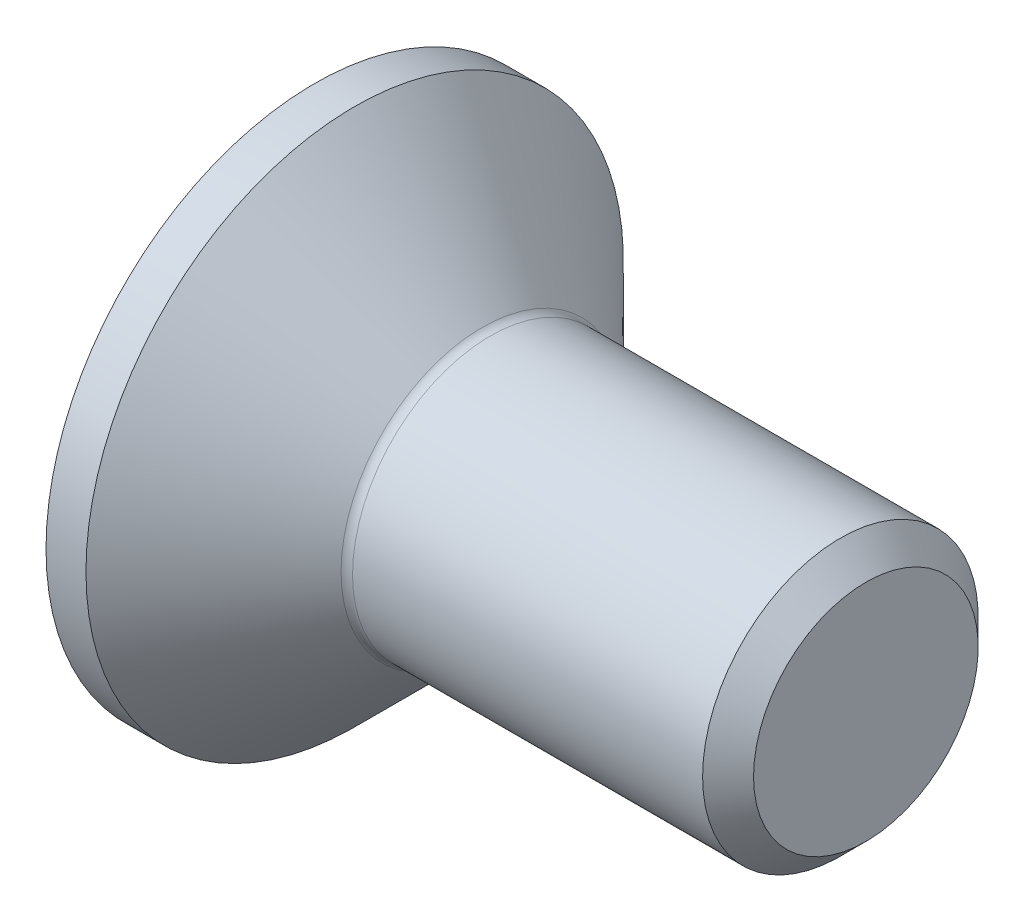
ISO-10303-21;
HEADER;
FILE_DESCRIPTION(('STEP AP214'),'2;1');
FILE_NAME('part.step','',(''),(''),'','','');
FILE_SCHEMA(('AUTOMOTIVE_DESIGN { 1 0 10303 214 1 1 1 1 }'));
ENDSEC;
DATA;
#1=APPLICATION_CONTEXT('core data for automotive mechanical design processes');
#2=APPLICATION_PROTOCOL_DEFINITION('international standard','automotive_design',2000,#1);
#3=PRODUCT_CONTEXT('',#1,'mechanical');
#4=PRODUCT('Part','Part','',(#3));
#5=PRODUCT_RELATED_PRODUCT_CATEGORY('part','',(#4));
#6=PRODUCT_DEFINITION_FORMATION('','',#4);
#7=PRODUCT_DEFINITION_CONTEXT('part definition',#1,'design');
#8=PRODUCT_DEFINITION('design','',#6,#7);
#9=PRODUCT_DEFINITION_SHAPE('','',#8);
#10=(LENGTH_UNIT() NAMED_UNIT(*) SI_UNIT(.MILLI.,.METRE.));
#11=(NAMED_UNIT(*) PLANE_ANGLE_UNIT() SI_UNIT($,.RADIAN.));
#12=(NAMED_UNIT(*) SI_UNIT($,.STERADIAN.) SOLID_ANGLE_UNIT());
#13=UNCERTAINTY_MEASURE_WITH_UNIT(LENGTH_MEASURE(1.E-05),#10,'distance_accuracy_value','');
#14=(GEOMETRIC_REPRESENTATION_CONTEXT(3) GLOBAL_UNCERTAINTY_ASSIGNED_CONTEXT((#13)) GLOBAL_UNIT_ASSIGNED_CONTEXT((#10,
#11,#12)) REPRESENTATION_CONTEXT('',''));
#15=CARTESIAN_POINT('',(0.,0.,0.));
#16=DIRECTION('',(0.,0.,1.));
#17=DIRECTION('',(1.,0.,0.));
#18=AXIS2_PLACEMENT_3D('',#15,#16,#17);
#19=CARTESIAN_POINT('',(0.,0.,0.));
#20=DIRECTION('',(-1.,0.,0.));
#21=DIRECTION('',(0.,0.,1.));
#22=AXIS2_PLACEMENT_3D('',#19,#20,#21);
#23=PLANE('',#22);
#24=CARTESIAN_POINT('',(0.,0.,0.));
#25=DIRECTION('',(-1.,0.,0.));
#26=DIRECTION('',(0.,0.,1.));
#27=AXIS2_PLACEMENT_3D('',#24,#25,#26);
#28=CIRCLE('',#27,5.85);
#29=CARTESIAN_POINT('',(0.,0.,5.85));
#30=VERTEX_POINT('',#29);
#31=EDGE_CURVE('E145',#30,#30,#28,.T.);
#32=ORIENTED_EDGE('',*,*,#31,.T.);
#33=EDGE_LOOP('',(#32));
#34=FACE_BOUND('',#33,.T.);
#35=DIRECTION('',(0.,-0.5,-0.866025403784439));
#36=VECTOR('',#35,1.);
#37=CARTESIAN_POINT('',(0.,-1.15470053837925,2.));
#38=LINE('',#37,#36);
#39=CARTESIAN_POINT('',(0.,-1.15470053837925,2.));
#40=VERTEX_POINT('',#39);
#41=CARTESIAN_POINT('',(0.,-2.3094010767585,0.));
#42=VERTEX_POINT('',#41);
#43=EDGE_CURVE('E121',#40,#42,#38,.T.);
#44=ORIENTED_EDGE('',*,*,#43,.T.);
#45=DIRECTION('',(0.,0.5,-0.866025403784439));
#46=VECTOR('',#45,1.);
#47=CARTESIAN_POINT('',(0.,-2.3094010767585,0.));
#48=LINE('',#47,#46);
#49=CARTESIAN_POINT('',(0.,-1.15470053837925,-2.));
#50=VERTEX_POINT('',#49);
#51=EDGE_CURVE('E52',#42,#50,#48,.T.);
#52=ORIENTED_EDGE('',*,*,#51,.T.);
#53=DIRECTION('',(0.,1.,0.));
#54=VECTOR('',#53,1.);
#55=CARTESIAN_POINT('',(0.,-1.15470053837925,-2.));
#56=LINE('',#55,#54);
#57=CARTESIAN_POINT('',(0.,1.15470053837925,-2.));
#58=VERTEX_POINT('',#57);
#59=EDGE_CURVE('E132',#50,#58,#56,.T.);
#60=ORIENTED_EDGE('',*,*,#59,.T.);
#61=DIRECTION('',(0.,0.5,0.866025403784439));
#62=VECTOR('',#61,1.);
#63=CARTESIAN_POINT('',(0.,1.15470053837925,-2.));
#64=LINE('',#63,#62);
#65=CARTESIAN_POINT('',(0.,2.3094010767585,0.));
#66=VERTEX_POINT('',#65);
#67=EDGE_CURVE('E380',#58,#66,#64,.T.);
#68=ORIENTED_EDGE('',*,*,#67,.T.);
#69=DIRECTION('',(0.,-0.5,0.866025403784438));
#70=VECTOR('',#69,1.);
#71=CARTESIAN_POINT('',(0.,2.3094010767585,0.));
#72=LINE('',#71,#70);
#73=CARTESIAN_POINT('',(0.,1.15470053837925,2.));
#74=VERTEX_POINT('',#73);
#75=EDGE_CURVE('E383',#66,#74,#72,.T.);
#76=ORIENTED_EDGE('',*,*,#75,.T.);
#77=DIRECTION('',(0.,-1.,0.));
#78=VECTOR('',#77,1.);
#79=CARTESIAN_POINT('',(0.,1.15470053837925,2.));
#80=LINE('',#79,#78);
#81=EDGE_CURVE('E386',#74,#40,#80,.T.);
#82=ORIENTED_EDGE('',*,*,#81,.T.);
#83=EDGE_LOOP('',(#44,#52,#60,#68,#76,#82));
#84=FACE_BOUND('',#83,.T.);
#85=ADVANCED_FACE('F37',(#34,#84),#23,.T.);
#86=CARTESIAN_POINT('',(12.,2.4455,0.));
#87=DIRECTION('',(1.,0.,0.));
#88=DIRECTION('',(0.,0.,-1.));
#89=AXIS2_PLACEMENT_3D('',#86,#87,#88);
#90=PLANE('',#89);
#91=CARTESIAN_POINT('',(12.,0.,0.));
#92=DIRECTION('',(-1.,0.,0.));
#93=DIRECTION('',(0.,0.,1.));
#94=AXIS2_PLACEMENT_3D('',#91,#92,#93);
#95=CIRCLE('',#94,2.4455);
#96=CARTESIAN_POINT('',(12.,0.,2.4455));
#97=VERTEX_POINT('',#96);
#98=EDGE_CURVE('E155',#97,#97,#95,.T.);
#99=ORIENTED_EDGE('',*,*,#98,.F.);
#100=EDGE_LOOP('',(#99));
#101=FACE_BOUND('',#100,.T.);
#102=ADVANCED_FACE('F175',(#101),#90,.T.);
#103=CARTESIAN_POINT('',(12.,0.,0.));
#104=DIRECTION('',(-1.,0.,0.));
#105=DIRECTION('',(0.,0.,1.));
#106=AXIS2_PLACEMENT_3D('',#103,#104,#105);
#107=CONICAL_SURFACE('',#106,2.4455,0.785398163397468);
#108=CARTESIAN_POINT('',(11.4455,0.,0.));
#109=DIRECTION('',(-1.,0.,0.));
#110=DIRECTION('',(0.,0.,1.));
#111=AXIS2_PLACEMENT_3D('',#108,#109,#110);
#112=CIRCLE('',#111,3.);
#113=CARTESIAN_POINT('',(11.4455,0.,3.));
#114=VERTEX_POINT('',#113);
#115=EDGE_CURVE('E152',#114,#114,#112,.T.);
#116=ORIENTED_EDGE('',*,*,#115,.F.);
#117=EDGE_LOOP('',(#116));
#118=FACE_BOUND('',#117,.T.);
#119=ORIENTED_EDGE('',*,*,#98,.T.);
#120=EDGE_LOOP('',(#119));
#121=FACE_BOUND('',#120,.T.);
#122=ADVANCED_FACE('F181',(#118,#121),#107,.T.);
#123=CARTESIAN_POINT('',(0.,0.,0.));
#124=DIRECTION('',(-1.,0.,0.));
#125=DIRECTION('',(0.,0.,1.));
#126=AXIS2_PLACEMENT_3D('',#123,#124,#125);
#127=CYLINDRICAL_SURFACE('',#126,3.);
#128=CARTESIAN_POINT('',(3.82355339059328,0.,0.));
#129=DIRECTION('',(-1.,0.,0.));
#130=DIRECTION('',(0.,0.,1.));
#131=AXIS2_PLACEMENT_3D('',#128,#129,#130);
#132=CIRCLE('',#131,3.);
#133=CARTESIAN_POINT('',(3.82355339059328,0.,3.));
#134=VERTEX_POINT('',#133);
#135=EDGE_CURVE('E11',#134,#134,#132,.F.);
#136=ORIENTED_EDGE('',*,*,#135,.T.);
#137=EDGE_LOOP('',(#136));
#138=FACE_BOUND('',#137,.T.);
#139=ORIENTED_EDGE('',*,*,#115,.T.);
#140=EDGE_LOOP('',(#139));
#141=FACE_BOUND('',#140,.T.);
#142=ADVANCED_FACE('F189',(#138,#141),#127,.T.);
#143=CARTESIAN_POINT('',(0.870000000000014,0.,0.));
#144=DIRECTION('',(-1.,0.,0.));
#145=DIRECTION('',(0.,0.,1.));
#146=AXIS2_PLACEMENT_3D('',#143,#144,#145);
#147=CONICAL_SURFACE('',#146,5.85,0.78539816339745);
#148=CARTESIAN_POINT('',(3.64677669529664,0.,0.));
#149=DIRECTION('',(-1.,0.,0.));
#150=DIRECTION('',(0.,0.,1.));
#151=AXIS2_PLACEMENT_3D('',#148,#149,#150);
#152=CIRCLE('',#151,3.07322330470336);
#153=CARTESIAN_POINT('',(3.64677669529664,0.,3.07322330470336));
#154=VERTEX_POINT('',#153);
#155=EDGE_CURVE('E45',#154,#154,#152,.T.);
#156=ORIENTED_EDGE('',*,*,#155,.T.);
#157=EDGE_LOOP('',(#156));
#158=FACE_BOUND('',#157,.T.);
#159=CARTESIAN_POINT('',(0.870000000000014,0.,0.));
#160=DIRECTION('',(-1.,0.,0.));
#161=DIRECTION('',(0.,0.,1.));
#162=AXIS2_PLACEMENT_3D('',#159,#160,#161);
#163=CIRCLE('',#162,5.85);
#164=CARTESIAN_POINT('',(0.870000000000014,0.,5.85));
#165=VERTEX_POINT('',#164);
#166=EDGE_CURVE('E149',#165,#165,#163,.T.);
#167=ORIENTED_EDGE('',*,*,#166,.F.);
#168=EDGE_LOOP('',(#167));
#169=FACE_BOUND('',#168,.T.);
#170=ADVANCED_FACE('F160',(#158,#169),#147,.T.);
#171=CARTESIAN_POINT('',(0.,0.,0.));
#172=DIRECTION('',(-1.,0.,0.));
#173=DIRECTION('',(0.,0.,1.));
#174=AXIS2_PLACEMENT_3D('',#171,#172,#173);
#175=CYLINDRICAL_SURFACE('',#174,5.85);
#176=ORIENTED_EDGE('',*,*,#166,.T.);
#177=EDGE_LOOP('',(#176));
#178=FACE_BOUND('',#177,.T.);
#179=ORIENTED_EDGE('',*,*,#31,.F.);
#180=EDGE_LOOP('',(#179));
#181=FACE_BOUND('',#180,.T.);
#182=ADVANCED_FACE('F164',(#178,#181),#175,.T.);
#183=CARTESIAN_POINT('',(3.82355339059328,0.,0.));
#184=DIRECTION('',(-1.,0.,0.));
#185=DIRECTION('',(0.,0.,1.));
#186=AXIS2_PLACEMENT_3D('',#183,#184,#185);
#187=TOROIDAL_SURFACE('',#186,3.25,0.25);
#188=ORIENTED_EDGE('',*,*,#135,.F.);
#189=EDGE_LOOP('',(#188));
#190=FACE_BOUND('',#189,.T.);
#191=ORIENTED_EDGE('',*,*,#155,.F.);
#192=EDGE_LOOP('',(#191));
#193=FACE_BOUND('',#192,.T.);
#194=ADVANCED_FACE('F39',(#190,#193),#187,.F.);
#195=CARTESIAN_POINT('',(2.2,-2.3094010767585,0.));
#196=DIRECTION('',(0.,0.866025403784439,0.5));
#197=DIRECTION('',(0.,-0.5,0.866025403784439));
#198=AXIS2_PLACEMENT_3D('',#195,#196,#197);
#199=PLANE('',#198);
#200=ORIENTED_EDGE('',*,*,#51,.F.);
#201=DIRECTION('',(-1.,0.,0.));
#202=VECTOR('',#201,1.);
#203=CARTESIAN_POINT('',(2.2,-2.3094010767585,0.));
#204=LINE('',#203,#202);
#205=CARTESIAN_POINT('',(2.2,-2.3094010767585,0.));
#206=VERTEX_POINT('',#205);
#207=EDGE_CURVE('E377',#206,#42,#204,.T.);
#208=ORIENTED_EDGE('',*,*,#207,.F.);
#209=DIRECTION('',(0.,0.5,-0.866025403784439));
#210=VECTOR('',#209,1.);
#211=CARTESIAN_POINT('',(2.2,-2.3094010767585,0.));
#212=LINE('',#211,#210);
#213=CARTESIAN_POINT('',(2.2,-1.73205080756888,-1.));
#214=VERTEX_POINT('',#213);
#215=EDGE_CURVE('E117',#206,#214,#212,.T.);
#216=ORIENTED_EDGE('',*,*,#215,.T.);
#217=CARTESIAN_POINT('',(2.2,-1.15470053837925,-2.));
#218=VERTEX_POINT('',#217);
#219=EDGE_CURVE('E113',#214,#218,#212,.T.);
#220=ORIENTED_EDGE('',*,*,#219,.T.);
#221=DIRECTION('',(-1.,0.,0.));
#222=VECTOR('',#221,1.);
#223=CARTESIAN_POINT('',(2.2,-1.15470053837925,-2.));
#224=LINE('',#223,#222);
#225=EDGE_CURVE('E115',#218,#50,#224,.T.);
#226=ORIENTED_EDGE('',*,*,#225,.T.);
#227=EDGE_LOOP('',(#200,#208,#216,#220,#226));
#228=FACE_BOUND('',#227,.T.);
#229=ADVANCED_FACE('F114',(#228),#199,.T.);
#230=CARTESIAN_POINT('',(2.2,-1.15470053837925,-2.));
#231=DIRECTION('',(0.,0.,1.));
#232=DIRECTION('',(1.,0.,0.));
#233=AXIS2_PLACEMENT_3D('',#230,#231,#232);
#234=PLANE('',#233);
#235=ORIENTED_EDGE('',*,*,#59,.F.);
#236=ORIENTED_EDGE('',*,*,#225,.F.);
#237=DIRECTION('',(0.,1.,0.));
#238=VECTOR('',#237,1.);
#239=CARTESIAN_POINT('',(2.2,-1.15470053837925,-2.));
#240=LINE('',#239,#238);
#241=CARTESIAN_POINT('',(2.2,0.,-2.));
#242=VERTEX_POINT('',#241);
#243=EDGE_CURVE('E60',#218,#242,#240,.T.);
#244=ORIENTED_EDGE('',*,*,#243,.T.);
#245=CARTESIAN_POINT('',(2.2,1.15470053837925,-2.));
#246=VERTEX_POINT('',#245);
#247=EDGE_CURVE('E127',#242,#246,#240,.T.);
#248=ORIENTED_EDGE('',*,*,#247,.T.);
#249=DIRECTION('',(-1.,0.,0.));
#250=VECTOR('',#249,1.);
#251=CARTESIAN_POINT('',(2.2,1.15470053837925,-2.));
#252=LINE('',#251,#250);
#253=EDGE_CURVE('E134',#246,#58,#252,.T.);
#254=ORIENTED_EDGE('',*,*,#253,.T.);
#255=EDGE_LOOP('',(#235,#236,#244,#248,#254));
#256=FACE_BOUND('',#255,.T.);
#257=ADVANCED_FACE('F129',(#256),#234,.T.);
#258=CARTESIAN_POINT('',(2.2,1.15470053837925,-2.));
#259=DIRECTION('',(0.,-0.866025403784438,0.5));
#260=DIRECTION('',(0.,-0.5,-0.866025403784439));
#261=AXIS2_PLACEMENT_3D('',#258,#259,#260);
#262=PLANE('',#261);
#263=ORIENTED_EDGE('',*,*,#67,.F.);
#264=ORIENTED_EDGE('',*,*,#253,.F.);
#265=DIRECTION('',(0.,0.5,0.866025403784439));
#266=VECTOR('',#265,1.);
#267=CARTESIAN_POINT('',(2.2,1.15470053837925,-2.));
#268=LINE('',#267,#266);
#269=CARTESIAN_POINT('',(2.2,1.73205080756888,-1.));
#270=VERTEX_POINT('',#269);
#271=EDGE_CURVE('E358',#246,#270,#268,.T.);
#272=ORIENTED_EDGE('',*,*,#271,.T.);
#273=CARTESIAN_POINT('',(2.2,2.3094010767585,0.));
#274=VERTEX_POINT('',#273);
#275=EDGE_CURVE('E126',#270,#274,#268,.T.);
#276=ORIENTED_EDGE('',*,*,#275,.T.);
#277=DIRECTION('',(-1.,0.,0.));
#278=VECTOR('',#277,1.);
#279=CARTESIAN_POINT('',(2.2,2.3094010767585,0.));
#280=LINE('',#279,#278);
#281=EDGE_CURVE('E140',#274,#66,#280,.T.);
#282=ORIENTED_EDGE('',*,*,#281,.T.);
#283=EDGE_LOOP('',(#263,#264,#272,#276,#282));
#284=FACE_BOUND('',#283,.T.);
#285=ADVANCED_FACE('F261',(#284),#262,.T.);
#286=CARTESIAN_POINT('',(2.2,2.3094010767585,0.));
#287=DIRECTION('',(0.,-0.866025403784439,-0.5));
#288=DIRECTION('',(0.,0.5,-0.866025403784438));
#289=AXIS2_PLACEMENT_3D('',#286,#287,#288);
#290=PLANE('',#289);
#291=ORIENTED_EDGE('',*,*,#75,.F.);
#292=ORIENTED_EDGE('',*,*,#281,.F.);
#293=DIRECTION('',(0.,-0.5,0.866025403784438));
#294=VECTOR('',#293,1.);
#295=CARTESIAN_POINT('',(2.2,2.3094010767585,0.));
#296=LINE('',#295,#294);
#297=CARTESIAN_POINT('',(2.2,1.73205080756888,1.));
#298=VERTEX_POINT('',#297);
#299=EDGE_CURVE('E365',#274,#298,#296,.T.);
#300=ORIENTED_EDGE('',*,*,#299,.T.);
#301=CARTESIAN_POINT('',(2.2,1.15470053837925,2.));
#302=VERTEX_POINT('',#301);
#303=EDGE_CURVE('E363',#298,#302,#296,.T.);
#304=ORIENTED_EDGE('',*,*,#303,.T.);
#305=DIRECTION('',(-1.,0.,0.));
#306=VECTOR('',#305,1.);
#307=CARTESIAN_POINT('',(2.2,1.15470053837925,2.));
#308=LINE('',#307,#306);
#309=EDGE_CURVE('E395',#302,#74,#308,.T.);
#310=ORIENTED_EDGE('',*,*,#309,.T.);
#311=EDGE_LOOP('',(#291,#292,#300,#304,#310));
#312=FACE_BOUND('',#311,.T.);
#313=ADVANCED_FACE('F269',(#312),#290,.T.);
#314=CARTESIAN_POINT('',(2.2,1.15470053837925,2.));
#315=DIRECTION('',(0.,0.,-1.));
#316=DIRECTION('',(-1.,0.,0.));
#317=AXIS2_PLACEMENT_3D('',#314,#315,#316);
#318=PLANE('',#317);
#319=ORIENTED_EDGE('',*,*,#81,.F.);
#320=ORIENTED_EDGE('',*,*,#309,.F.);
#321=DIRECTION('',(0.,-1.,0.));
#322=VECTOR('',#321,1.);
#323=CARTESIAN_POINT('',(2.2,1.15470053837925,2.));
#324=LINE('',#323,#322);
#325=CARTESIAN_POINT('',(2.2,0.,2.));
#326=VERTEX_POINT('',#325);
#327=EDGE_CURVE('E370',#302,#326,#324,.T.);
#328=ORIENTED_EDGE('',*,*,#327,.T.);
#329=CARTESIAN_POINT('',(2.2,-1.15470053837925,2.));
#330=VERTEX_POINT('',#329);
#331=EDGE_CURVE('E369',#326,#330,#324,.T.);
#332=ORIENTED_EDGE('',*,*,#331,.T.);
#333=DIRECTION('',(-1.,0.,0.));
#334=VECTOR('',#333,1.);
#335=CARTESIAN_POINT('',(2.2,-1.15470053837925,2.));
#336=LINE('',#335,#334);
#337=EDGE_CURVE('E392',#330,#40,#336,.T.);
#338=ORIENTED_EDGE('',*,*,#337,.T.);
#339=EDGE_LOOP('',(#319,#320,#328,#332,#338));
#340=FACE_BOUND('',#339,.T.);
#341=ADVANCED_FACE('F278',(#340),#318,.T.);
#342=CARTESIAN_POINT('',(2.2,-1.15470053837925,2.));
#343=DIRECTION('',(0.,0.866025403784439,-0.5));
#344=DIRECTION('',(0.,0.5,0.866025403784439));
#345=AXIS2_PLACEMENT_3D('',#342,#343,#344);
#346=PLANE('',#345);
#347=ORIENTED_EDGE('',*,*,#43,.F.);
#348=ORIENTED_EDGE('',*,*,#337,.F.);
#349=DIRECTION('',(0.,-0.5,-0.866025403784439));
#350=VECTOR('',#349,1.);
#351=CARTESIAN_POINT('',(2.2,-1.15470053837925,2.));
#352=LINE('',#351,#350);
#353=CARTESIAN_POINT('',(2.2,-1.73205080756888,1.));
#354=VERTEX_POINT('',#353);
#355=EDGE_CURVE('E374',#330,#354,#352,.T.);
#356=ORIENTED_EDGE('',*,*,#355,.T.);
#357=EDGE_CURVE('E373',#354,#206,#352,.T.);
#358=ORIENTED_EDGE('',*,*,#357,.T.);
#359=ORIENTED_EDGE('',*,*,#207,.T.);
#360=EDGE_LOOP('',(#347,#348,#356,#358,#359));
#361=FACE_BOUND('',#360,.T.);
#362=ADVANCED_FACE('F287',(#361),#346,.T.);
#363=CARTESIAN_POINT('',(2.2,-1.15470053837925,-2.));
#364=DIRECTION('',(1.,0.,0.));
#365=DIRECTION('',(0.,0.,-1.));
#366=AXIS2_PLACEMENT_3D('',#363,#364,#365);
#367=PLANE('',#366);
#368=ORIENTED_EDGE('',*,*,#243,.F.);
#369=ORIENTED_EDGE('',*,*,#219,.F.);
#370=CARTESIAN_POINT('',(2.2,0.,0.));
#371=DIRECTION('',(-1.,0.,0.));
#372=DIRECTION('',(0.,0.,1.));
#373=AXIS2_PLACEMENT_3D('',#370,#371,#372);
#374=CIRCLE('',#373,2.);
#375=EDGE_CURVE('E124',#242,#214,#374,.T.);
#376=ORIENTED_EDGE('',*,*,#375,.F.);
#377=EDGE_LOOP('',(#368,#369,#376));
#378=FACE_BOUND('',#377,.T.);
#379=ADVANCED_FACE('F123',(#378),#367,.F.);
#380=ORIENTED_EDGE('',*,*,#215,.F.);
#381=ORIENTED_EDGE('',*,*,#357,.F.);
#382=EDGE_CURVE('E137',#214,#354,#374,.T.);
#383=ORIENTED_EDGE('',*,*,#382,.F.);
#384=EDGE_LOOP('',(#380,#381,#383));
#385=FACE_BOUND('',#384,.T.);
#386=ADVANCED_FACE('F304',(#385),#367,.F.);
#387=ORIENTED_EDGE('',*,*,#355,.F.);
#388=ORIENTED_EDGE('',*,*,#331,.F.);
#389=EDGE_CURVE('E133',#354,#326,#374,.T.);
#390=ORIENTED_EDGE('',*,*,#389,.F.);
#391=EDGE_LOOP('',(#387,#388,#390));
#392=FACE_BOUND('',#391,.T.);
#393=ADVANCED_FACE('F312',(#392),#367,.F.);
#394=ORIENTED_EDGE('',*,*,#327,.F.);
#395=ORIENTED_EDGE('',*,*,#303,.F.);
#396=EDGE_CURVE('E139',#326,#298,#374,.T.);
#397=ORIENTED_EDGE('',*,*,#396,.F.);
#398=EDGE_LOOP('',(#394,#395,#397));
#399=FACE_BOUND('',#398,.T.);
#400=ADVANCED_FACE('F320',(#399),#367,.F.);
#401=ORIENTED_EDGE('',*,*,#299,.F.);
#402=ORIENTED_EDGE('',*,*,#275,.F.);
#403=EDGE_CURVE('E146',#298,#270,#374,.T.);
#404=ORIENTED_EDGE('',*,*,#403,.F.);
#405=EDGE_LOOP('',(#401,#402,#404));
#406=FACE_BOUND('',#405,.T.);
#407=ADVANCED_FACE('F328',(#406),#367,.F.);
#408=ORIENTED_EDGE('',*,*,#271,.F.);
#409=ORIENTED_EDGE('',*,*,#247,.F.);
#410=EDGE_CURVE('E359',#270,#242,#374,.T.);
#411=ORIENTED_EDGE('',*,*,#410,.F.);
#412=EDGE_LOOP('',(#408,#409,#411));
#413=FACE_BOUND('',#412,.T.);
#414=ADVANCED_FACE('F243',(#413),#367,.F.);
#415=CARTESIAN_POINT('',(2.2,0.,0.));
#416=DIRECTION('',(-1.,0.,0.));
#417=DIRECTION('',(0.,0.,1.));
#418=AXIS2_PLACEMENT_3D('',#415,#416,#417);
#419=CONICAL_SURFACE('',#418,2.,1.04719755119659);
#420=CARTESIAN_POINT('',(3.35470053837927,0.,0.));
#421=VERTEX_POINT('',#420);
#422=VERTEX_LOOP('',#421);
#423=FACE_BOUND('',#422,.T.);
#424=ORIENTED_EDGE('',*,*,#396,.T.);
#425=ORIENTED_EDGE('',*,*,#403,.T.);
#426=ORIENTED_EDGE('',*,*,#410,.T.);
#427=ORIENTED_EDGE('',*,*,#375,.T.);
#428=ORIENTED_EDGE('',*,*,#382,.T.);
#429=ORIENTED_EDGE('',*,*,#389,.T.);
#430=EDGE_LOOP('',(#424,#425,#426,#427,#428,#429));
#431=FACE_BOUND('',#430,.T.);
#432=ADVANCED_FACE('F185',(#423,#431),#419,.F.);
#433=CLOSED_SHELL('',(#85,#102,#122,#142,#170,#182,#194,#229,#257,#285,#313,#341,#362,#379,#386,
#393,#400,#407,#414,#432));
#434=MANIFOLD_SOLID_BREP('B2',#433);
#435=ADVANCED_BREP_SHAPE_REPRESENTATION('',(#18,#434),#14);
#436=SHAPE_DEFINITION_REPRESENTATION(#9,#435);
ENDSEC;
END-ISO-10303-21;
